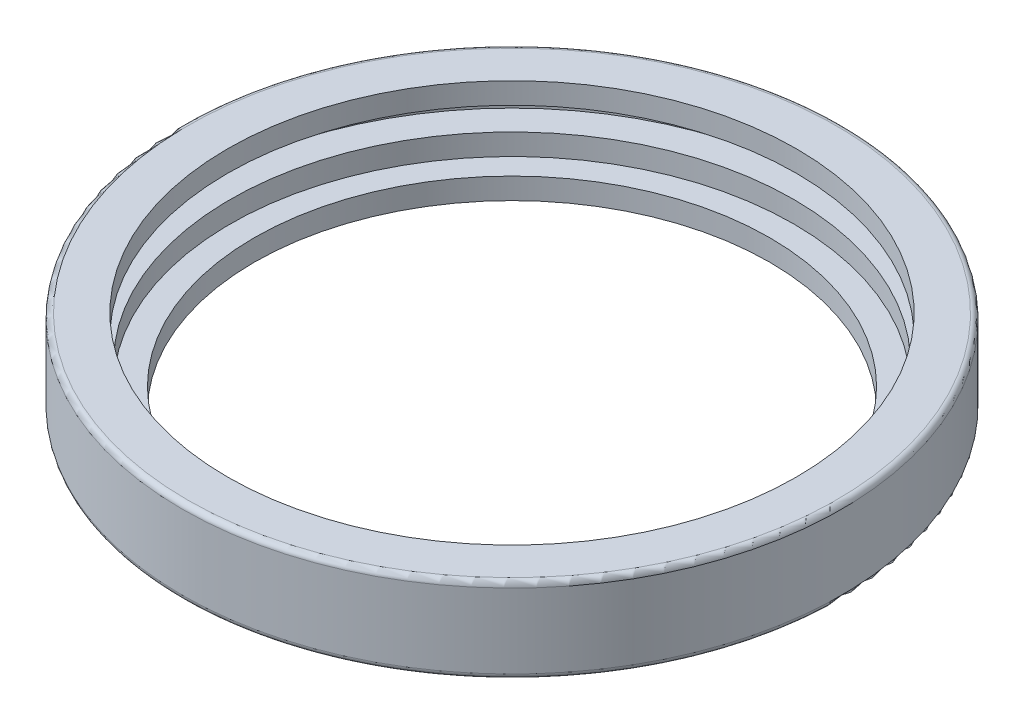
ISO-10303-21;
HEADER;
FILE_DESCRIPTION(('STEP AP214'),'2;1');
FILE_NAME('part.step','',(''),(''),'','','');
FILE_SCHEMA(('AUTOMOTIVE_DESIGN { 1 0 10303 214 1 1 1 1 }'));
ENDSEC;
DATA;
#1=APPLICATION_CONTEXT('core data for automotive mechanical design processes');
#2=APPLICATION_PROTOCOL_DEFINITION('international standard','automotive_design',2000,#1);
#3=PRODUCT_CONTEXT('',#1,'mechanical');
#4=PRODUCT('Part','Part','',(#3));
#5=PRODUCT_RELATED_PRODUCT_CATEGORY('part','',(#4));
#6=PRODUCT_DEFINITION_FORMATION('','',#4);
#7=PRODUCT_DEFINITION_CONTEXT('part definition',#1,'design');
#8=PRODUCT_DEFINITION('design','',#6,#7);
#9=PRODUCT_DEFINITION_SHAPE('','',#8);
#10=(LENGTH_UNIT() NAMED_UNIT(*) SI_UNIT(.MILLI.,.METRE.));
#11=(NAMED_UNIT(*) PLANE_ANGLE_UNIT() SI_UNIT($,.RADIAN.));
#12=(NAMED_UNIT(*) SI_UNIT($,.STERADIAN.) SOLID_ANGLE_UNIT());
#13=UNCERTAINTY_MEASURE_WITH_UNIT(LENGTH_MEASURE(1.E-05),#10,'distance_accuracy_value','');
#14=(GEOMETRIC_REPRESENTATION_CONTEXT(3) GLOBAL_UNCERTAINTY_ASSIGNED_CONTEXT((#13)) GLOBAL_UNIT_ASSIGNED_CONTEXT((#10,
#11,#12)) REPRESENTATION_CONTEXT('',''));
#15=CARTESIAN_POINT('',(0.,0.,0.));
#16=DIRECTION('',(0.,0.,1.));
#17=DIRECTION('',(1.,0.,0.));
#18=AXIS2_PLACEMENT_3D('',#15,#16,#17);
#19=CARTESIAN_POINT('',(0.,0.,0.));
#20=DIRECTION('',(0.,-1.,0.));
#21=DIRECTION('',(0.,0.,-1.));
#22=AXIS2_PLACEMENT_3D('',#19,#20,#21);
#23=CYLINDRICAL_SURFACE('',#22,24.25);
#24=CARTESIAN_POINT('',(0.,0.,0.));
#25=DIRECTION('',(0.,-1.,0.));
#26=DIRECTION('',(0.,0.,-1.));
#27=AXIS2_PLACEMENT_3D('',#24,#25,#26);
#28=CIRCLE('',#27,24.25);
#29=CARTESIAN_POINT('',(0.,0.,-24.25));
#30=VERTEX_POINT('',#29);
#31=EDGE_CURVE('E52',#30,#30,#28,.T.);
#32=ORIENTED_EDGE('',*,*,#31,.T.);
#33=EDGE_LOOP('',(#32));
#34=FACE_BOUND('',#33,.T.);
#35=CARTESIAN_POINT('',(0.,2.,0.));
#36=DIRECTION('',(0.,-1.,0.));
#37=DIRECTION('',(0.,0.,-1.));
#38=AXIS2_PLACEMENT_3D('',#35,#36,#37);
#39=CIRCLE('',#38,24.25);
#40=CARTESIAN_POINT('',(0.,2.,-24.25));
#41=VERTEX_POINT('',#40);
#42=EDGE_CURVE('E73',#41,#41,#39,.T.);
#43=ORIENTED_EDGE('',*,*,#42,.F.);
#44=EDGE_LOOP('',(#43));
#45=FACE_BOUND('',#44,.T.);
#46=ADVANCED_FACE('F32',(#34,#45),#23,.F.);
#47=CARTESIAN_POINT('',(24.25,0.,0.));
#48=DIRECTION('',(0.,-1.,0.));
#49=DIRECTION('',(0.,0.,-1.));
#50=AXIS2_PLACEMENT_3D('',#47,#48,#49);
#51=PLANE('',#50);
#52=CARTESIAN_POINT('',(0.,0.,0.));
#53=DIRECTION('',(0.,-1.,0.));
#54=DIRECTION('',(0.,0.,-1.));
#55=AXIS2_PLACEMENT_3D('',#52,#53,#54);
#56=CIRCLE('',#55,30.5);
#57=CARTESIAN_POINT('',(0.,0.,-30.5));
#58=VERTEX_POINT('',#57);
#59=EDGE_CURVE('E47',#58,#58,#56,.T.);
#60=ORIENTED_EDGE('',*,*,#59,.T.);
#61=EDGE_LOOP('',(#60));
#62=FACE_BOUND('',#61,.T.);
#63=ORIENTED_EDGE('',*,*,#31,.F.);
#64=EDGE_LOOP('',(#63));
#65=FACE_BOUND('',#64,.T.);
#66=ADVANCED_FACE('F81',(#62,#65),#51,.T.);
#67=CARTESIAN_POINT('',(0.,0.,0.));
#68=DIRECTION('',(0.,-1.,0.));
#69=DIRECTION('',(0.,0.,-1.));
#70=AXIS2_PLACEMENT_3D('',#67,#68,#69);
#71=CYLINDRICAL_SURFACE('',#70,31.);
#72=CARTESIAN_POINT('',(0.,0.5,0.));
#73=DIRECTION('',(0.,-1.,0.));
#74=DIRECTION('',(0.,0.,-1.));
#75=AXIS2_PLACEMENT_3D('',#72,#73,#74);
#76=CIRCLE('',#75,31.);
#77=CARTESIAN_POINT('',(0.,0.5,-31.));
#78=VERTEX_POINT('',#77);
#79=EDGE_CURVE('E39',#78,#78,#76,.F.);
#80=ORIENTED_EDGE('',*,*,#79,.T.);
#81=EDGE_LOOP('',(#80));
#82=FACE_BOUND('',#81,.T.);
#83=CARTESIAN_POINT('',(0.,7.5,0.));
#84=DIRECTION('',(0.,1.,0.));
#85=DIRECTION('',(0.,0.,1.));
#86=AXIS2_PLACEMENT_3D('',#83,#84,#85);
#87=CIRCLE('',#86,31.);
#88=CARTESIAN_POINT('',(0.,7.5,31.));
#89=VERTEX_POINT('',#88);
#90=EDGE_CURVE('E43',#89,#89,#87,.F.);
#91=ORIENTED_EDGE('',*,*,#90,.T.);
#92=EDGE_LOOP('',(#91));
#93=FACE_BOUND('',#92,.T.);
#94=ADVANCED_FACE('F87',(#82,#93),#71,.T.);
#95=CARTESIAN_POINT('',(31.,8.,0.));
#96=DIRECTION('',(0.,1.,0.));
#97=DIRECTION('',(0.,0.,1.));
#98=AXIS2_PLACEMENT_3D('',#95,#96,#97);
#99=PLANE('',#98);
#100=CARTESIAN_POINT('',(0.,8.,0.));
#101=DIRECTION('',(0.,1.,0.));
#102=DIRECTION('',(0.,0.,1.));
#103=AXIS2_PLACEMENT_3D('',#100,#101,#102);
#104=CIRCLE('',#103,30.5);
#105=CARTESIAN_POINT('',(0.,8.,30.5));
#106=VERTEX_POINT('',#105);
#107=EDGE_CURVE('E10',#106,#106,#104,.T.);
#108=ORIENTED_EDGE('',*,*,#107,.T.);
#109=EDGE_LOOP('',(#108));
#110=FACE_BOUND('',#109,.T.);
#111=CARTESIAN_POINT('',(0.,8.,0.));
#112=DIRECTION('',(0.,-1.,0.));
#113=DIRECTION('',(0.,0.,-1.));
#114=AXIS2_PLACEMENT_3D('',#111,#112,#113);
#115=CIRCLE('',#114,26.75);
#116=CARTESIAN_POINT('',(0.,8.,-26.75));
#117=VERTEX_POINT('',#116);
#118=EDGE_CURVE('E55',#117,#117,#115,.T.);
#119=ORIENTED_EDGE('',*,*,#118,.T.);
#120=EDGE_LOOP('',(#119));
#121=FACE_BOUND('',#120,.T.);
#122=ADVANCED_FACE('F126',(#110,#121),#99,.T.);
#123=CARTESIAN_POINT('',(0.,0.,0.));
#124=DIRECTION('',(0.,-1.,0.));
#125=DIRECTION('',(0.,0.,-1.));
#126=AXIS2_PLACEMENT_3D('',#123,#124,#125);
#127=CYLINDRICAL_SURFACE('',#126,26.75);
#128=CARTESIAN_POINT('',(0.,6.,0.));
#129=DIRECTION('',(0.,-1.,0.));
#130=DIRECTION('',(0.,0.,-1.));
#131=AXIS2_PLACEMENT_3D('',#128,#129,#130);
#132=CIRCLE('',#131,26.75);
#133=CARTESIAN_POINT('',(0.,6.,-26.75));
#134=VERTEX_POINT('',#133);
#135=EDGE_CURVE('E58',#134,#134,#132,.T.);
#136=ORIENTED_EDGE('',*,*,#135,.T.);
#137=EDGE_LOOP('',(#136));
#138=FACE_BOUND('',#137,.T.);
#139=ORIENTED_EDGE('',*,*,#118,.F.);
#140=EDGE_LOOP('',(#139));
#141=FACE_BOUND('',#140,.T.);
#142=ADVANCED_FACE('F122',(#138,#141),#127,.F.);
#143=CARTESIAN_POINT('',(26.75,6.,0.));
#144=DIRECTION('',(0.,-1.,0.));
#145=DIRECTION('',(0.,0.,-1.));
#146=AXIS2_PLACEMENT_3D('',#143,#144,#145);
#147=PLANE('',#146);
#148=CARTESIAN_POINT('',(0.,6.,0.));
#149=DIRECTION('',(0.,-1.,0.));
#150=DIRECTION('',(0.,0.,-1.));
#151=AXIS2_PLACEMENT_3D('',#148,#149,#150);
#152=CIRCLE('',#151,29.25);
#153=CARTESIAN_POINT('',(0.,6.,-29.25));
#154=VERTEX_POINT('',#153);
#155=EDGE_CURVE('E61',#154,#154,#152,.T.);
#156=ORIENTED_EDGE('',*,*,#155,.T.);
#157=EDGE_LOOP('',(#156));
#158=FACE_BOUND('',#157,.T.);
#159=ORIENTED_EDGE('',*,*,#135,.F.);
#160=EDGE_LOOP('',(#159));
#161=FACE_BOUND('',#160,.T.);
#162=ADVANCED_FACE('F118',(#158,#161),#147,.T.);
#163=CARTESIAN_POINT('',(0.,0.,0.));
#164=DIRECTION('',(0.,-1.,0.));
#165=DIRECTION('',(0.,0.,-1.));
#166=AXIS2_PLACEMENT_3D('',#163,#164,#165);
#167=CYLINDRICAL_SURFACE('',#166,29.25);
#168=CARTESIAN_POINT('',(0.,4.,0.));
#169=DIRECTION('',(0.,-1.,0.));
#170=DIRECTION('',(0.,0.,-1.));
#171=AXIS2_PLACEMENT_3D('',#168,#169,#170);
#172=CIRCLE('',#171,29.25);
#173=CARTESIAN_POINT('',(0.,4.,-29.25));
#174=VERTEX_POINT('',#173);
#175=EDGE_CURVE('E64',#174,#174,#172,.T.);
#176=ORIENTED_EDGE('',*,*,#175,.T.);
#177=EDGE_LOOP('',(#176));
#178=FACE_BOUND('',#177,.T.);
#179=ORIENTED_EDGE('',*,*,#155,.F.);
#180=EDGE_LOOP('',(#179));
#181=FACE_BOUND('',#180,.T.);
#182=ADVANCED_FACE('F114',(#178,#181),#167,.F.);
#183=CARTESIAN_POINT('',(29.25,4.,0.));
#184=DIRECTION('',(0.,1.,0.));
#185=DIRECTION('',(0.,0.,1.));
#186=AXIS2_PLACEMENT_3D('',#183,#184,#185);
#187=PLANE('',#186);
#188=CARTESIAN_POINT('',(0.,4.,0.));
#189=DIRECTION('',(0.,-1.,0.));
#190=DIRECTION('',(0.,0.,-1.));
#191=AXIS2_PLACEMENT_3D('',#188,#189,#190);
#192=CIRCLE('',#191,26.5);
#193=CARTESIAN_POINT('',(0.,4.,-26.5));
#194=VERTEX_POINT('',#193);
#195=EDGE_CURVE('E67',#194,#194,#192,.T.);
#196=ORIENTED_EDGE('',*,*,#195,.T.);
#197=EDGE_LOOP('',(#196));
#198=FACE_BOUND('',#197,.T.);
#199=ORIENTED_EDGE('',*,*,#175,.F.);
#200=EDGE_LOOP('',(#199));
#201=FACE_BOUND('',#200,.T.);
#202=ADVANCED_FACE('F108',(#198,#201),#187,.T.);
#203=CARTESIAN_POINT('',(0.,0.,0.));
#204=DIRECTION('',(0.,-1.,0.));
#205=DIRECTION('',(0.,0.,-1.));
#206=AXIS2_PLACEMENT_3D('',#203,#204,#205);
#207=CYLINDRICAL_SURFACE('',#206,26.5);
#208=CARTESIAN_POINT('',(0.,2.,0.));
#209=DIRECTION('',(0.,-1.,0.));
#210=DIRECTION('',(0.,0.,-1.));
#211=AXIS2_PLACEMENT_3D('',#208,#209,#210);
#212=CIRCLE('',#211,26.5);
#213=CARTESIAN_POINT('',(0.,2.,-26.5));
#214=VERTEX_POINT('',#213);
#215=EDGE_CURVE('E70',#214,#214,#212,.T.);
#216=ORIENTED_EDGE('',*,*,#215,.T.);
#217=EDGE_LOOP('',(#216));
#218=FACE_BOUND('',#217,.T.);
#219=ORIENTED_EDGE('',*,*,#195,.F.);
#220=EDGE_LOOP('',(#219));
#221=FACE_BOUND('',#220,.T.);
#222=ADVANCED_FACE('F99',(#218,#221),#207,.F.);
#223=CARTESIAN_POINT('',(26.5,2.,0.));
#224=DIRECTION('',(0.,1.,0.));
#225=DIRECTION('',(0.,0.,1.));
#226=AXIS2_PLACEMENT_3D('',#223,#224,#225);
#227=PLANE('',#226);
#228=ORIENTED_EDGE('',*,*,#42,.T.);
#229=EDGE_LOOP('',(#228));
#230=FACE_BOUND('',#229,.T.);
#231=ORIENTED_EDGE('',*,*,#215,.F.);
#232=EDGE_LOOP('',(#231));
#233=FACE_BOUND('',#232,.T.);
#234=ADVANCED_FACE('F77',(#230,#233),#227,.T.);
#235=CARTESIAN_POINT('',(0.,0.5,0.));
#236=DIRECTION('',(0.,-1.,0.));
#237=DIRECTION('',(0.,0.,-1.));
#238=AXIS2_PLACEMENT_3D('',#235,#236,#237);
#239=TOROIDAL_SURFACE('',#238,30.5,0.5);
#240=ORIENTED_EDGE('',*,*,#79,.F.);
#241=EDGE_LOOP('',(#240));
#242=FACE_BOUND('',#241,.T.);
#243=ORIENTED_EDGE('',*,*,#59,.F.);
#244=EDGE_LOOP('',(#243));
#245=FACE_BOUND('',#244,.T.);
#246=ADVANCED_FACE('F91',(#242,#245),#239,.T.);
#247=CARTESIAN_POINT('',(0.,7.5,0.));
#248=DIRECTION('',(0.,1.,0.));
#249=DIRECTION('',(0.,0.,1.));
#250=AXIS2_PLACEMENT_3D('',#247,#248,#249);
#251=TOROIDAL_SURFACE('',#250,30.5,0.5);
#252=ORIENTED_EDGE('',*,*,#107,.F.);
#253=EDGE_LOOP('',(#252));
#254=FACE_BOUND('',#253,.T.);
#255=ORIENTED_EDGE('',*,*,#90,.F.);
#256=EDGE_LOOP('',(#255));
#257=FACE_BOUND('',#256,.T.);
#258=ADVANCED_FACE('F34',(#254,#257),#251,.T.);
#259=CLOSED_SHELL('',(#46,#66,#94,#122,#142,#162,#182,#202,#222,#234,#246,#258));
#260=MANIFOLD_SOLID_BREP('B2',#259);
#261=ADVANCED_BREP_SHAPE_REPRESENTATION('',(#18,#260),#14);
#262=SHAPE_DEFINITION_REPRESENTATION(#9,#261);
ENDSEC;
END-ISO-10303-21;
